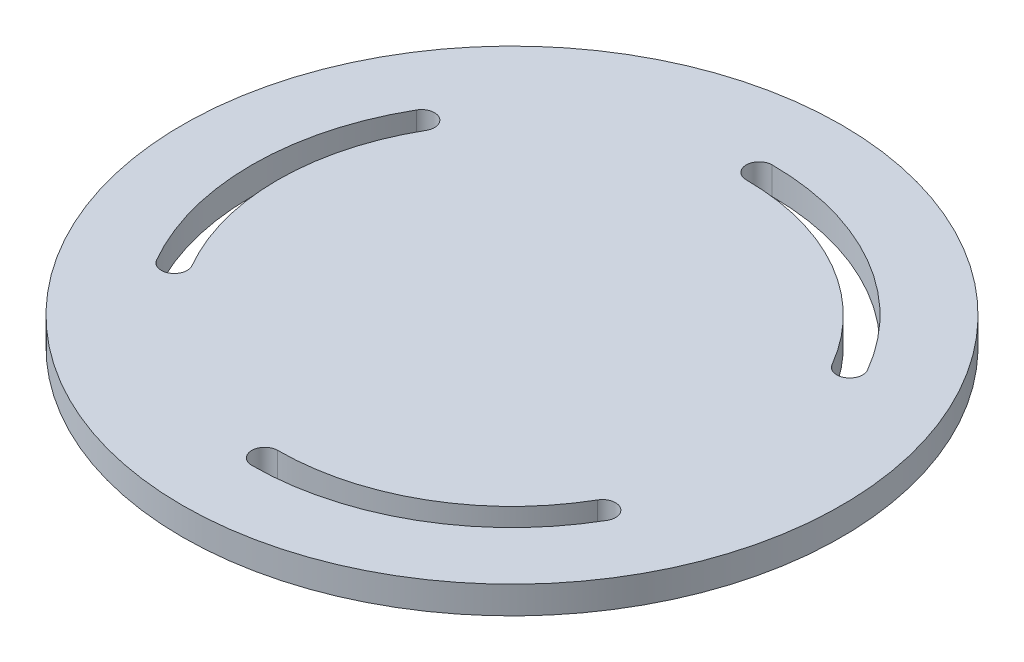
ISO-10303-21;
HEADER;
FILE_DESCRIPTION(('STEP AP214'),'2;1');
FILE_NAME('part.step','',(''),(''),'','','');
FILE_SCHEMA(('AUTOMOTIVE_DESIGN { 1 0 10303 214 1 1 1 1 }'));
ENDSEC;
DATA;
#1=APPLICATION_CONTEXT('core data for automotive mechanical design processes');
#2=APPLICATION_PROTOCOL_DEFINITION('international standard','automotive_design',2000,#1);
#3=PRODUCT_CONTEXT('',#1,'mechanical');
#4=PRODUCT('Part','Part','',(#3));
#5=PRODUCT_RELATED_PRODUCT_CATEGORY('part','',(#4));
#6=PRODUCT_DEFINITION_FORMATION('','',#4);
#7=PRODUCT_DEFINITION_CONTEXT('part definition',#1,'design');
#8=PRODUCT_DEFINITION('design','',#6,#7);
#9=PRODUCT_DEFINITION_SHAPE('','',#8);
#10=(LENGTH_UNIT() NAMED_UNIT(*) SI_UNIT(.MILLI.,.METRE.));
#11=(NAMED_UNIT(*) PLANE_ANGLE_UNIT() SI_UNIT($,.RADIAN.));
#12=(NAMED_UNIT(*) SI_UNIT($,.STERADIAN.) SOLID_ANGLE_UNIT());
#13=UNCERTAINTY_MEASURE_WITH_UNIT(LENGTH_MEASURE(1.E-05),#10,'distance_accuracy_value','');
#14=(GEOMETRIC_REPRESENTATION_CONTEXT(3) GLOBAL_UNCERTAINTY_ASSIGNED_CONTEXT((#13)) GLOBAL_UNIT_ASSIGNED_CONTEXT((#10,
#11,#12)) REPRESENTATION_CONTEXT('',''));
#15=CARTESIAN_POINT('',(0.,0.,0.));
#16=DIRECTION('',(0.,0.,1.));
#17=DIRECTION('',(1.,0.,0.));
#18=AXIS2_PLACEMENT_3D('',#15,#16,#17);
#19=CARTESIAN_POINT('',(0.,-6.35,0.));
#20=DIRECTION('',(0.,1.,0.));
#21=DIRECTION('',(0.,0.,1.));
#22=AXIS2_PLACEMENT_3D('',#19,#20,#21);
#23=CYLINDRICAL_SURFACE('',#22,76.1746);
#24=CARTESIAN_POINT('',(0.,-6.35,0.));
#25=DIRECTION('',(0.,1.,0.));
#26=DIRECTION('',(0.,0.,1.));
#27=AXIS2_PLACEMENT_3D('',#24,#25,#26);
#28=CIRCLE('',#27,76.1746);
#29=CARTESIAN_POINT('',(0.,-6.35,76.1746));
#30=VERTEX_POINT('',#29);
#31=EDGE_CURVE('E11',#30,#30,#28,.T.);
#32=ORIENTED_EDGE('',*,*,#31,.T.);
#33=EDGE_LOOP('',(#32));
#34=FACE_BOUND('',#33,.T.);
#35=CARTESIAN_POINT('',(0.,0.,0.));
#36=DIRECTION('',(0.,1.,0.));
#37=DIRECTION('',(0.,0.,1.));
#38=AXIS2_PLACEMENT_3D('',#35,#36,#37);
#39=CIRCLE('',#38,76.1746);
#40=CARTESIAN_POINT('',(0.,0.,76.1746));
#41=VERTEX_POINT('',#40);
#42=EDGE_CURVE('E36',#41,#41,#39,.T.);
#43=ORIENTED_EDGE('',*,*,#42,.F.);
#44=EDGE_LOOP('',(#43));
#45=FACE_BOUND('',#44,.T.);
#46=ADVANCED_FACE('F33',(#34,#45),#23,.T.);
#47=CARTESIAN_POINT('',(0.,-6.35,0.));
#48=DIRECTION('',(0.,1.,0.));
#49=DIRECTION('',(0.,0.,1.));
#50=AXIS2_PLACEMENT_3D('',#47,#48,#49);
#51=PLANE('',#50);
#52=CARTESIAN_POINT('',(-49.4933518262799,-6.35,-28.5749999999988));
#53=DIRECTION('',(0.,1.,0.));
#54=DIRECTION('',(0.,0.,1.));
#55=AXIS2_PLACEMENT_3D('',#52,#53,#54);
#56=CIRCLE('',#55,2.999999969);
#57=CARTESIAN_POINT('',(-46.8952756417734,-6.35,-27.0750000154987));
#58=VERTEX_POINT('',#57);
#59=CARTESIAN_POINT('',(-52.0914280107864,-6.35,-30.0749999844988));
#60=VERTEX_POINT('',#59);
#61=EDGE_CURVE('E129',#58,#60,#56,.T.);
#62=ORIENTED_EDGE('',*,*,#61,.T.);
#63=CARTESIAN_POINT('',(0.,-6.35,0.));
#64=DIRECTION('',(0.,1.,0.));
#65=DIRECTION('',(0.,0.,1.));
#66=AXIS2_PLACEMENT_3D('',#63,#64,#65);
#67=CIRCLE('',#66,60.1499999689994);
#68=CARTESIAN_POINT('',(-52.0914280107864,-6.35,30.0749999845013));
#69=VERTEX_POINT('',#68);
#70=EDGE_CURVE('E123',#60,#69,#67,.T.);
#71=ORIENTED_EDGE('',*,*,#70,.T.);
#72=CARTESIAN_POINT('',(-49.4933518262799,-6.35,28.5750000000014));
#73=DIRECTION('',(0.,1.,0.));
#74=DIRECTION('',(0.,0.,1.));
#75=AXIS2_PLACEMENT_3D('',#72,#73,#74);
#76=CIRCLE('',#75,2.999999969);
#77=CARTESIAN_POINT('',(-46.8952756417741,-6.35,27.0750000155));
#78=VERTEX_POINT('',#77);
#79=EDGE_CURVE('E132',#69,#78,#76,.T.);
#80=ORIENTED_EDGE('',*,*,#79,.T.);
#81=CARTESIAN_POINT('',(0.,-6.35,0.));
#82=DIRECTION('',(0.,-1.,0.));
#83=DIRECTION('',(0.,0.,1.));
#84=AXIS2_PLACEMENT_3D('',#81,#82,#83);
#85=CIRCLE('',#84,54.1500000309994);
#86=EDGE_CURVE('E47',#78,#58,#85,.T.);
#87=ORIENTED_EDGE('',*,*,#86,.T.);
#88=EDGE_LOOP('',(#62,#71,#80,#87));
#89=FACE_BOUND('',#88,.T.);
#90=CARTESIAN_POINT('',(-3.95516952522712E-13,-6.35,57.15));
#91=DIRECTION('',(0.,1.,0.));
#92=DIRECTION('',(0.,0.,1.));
#93=AXIS2_PLACEMENT_3D('',#90,#91,#92);
#94=CIRCLE('',#93,2.99999996899934);
#95=CARTESIAN_POINT('',(7.053034921501E-13,-6.35,54.1500000310007));
#96=VERTEX_POINT('',#95);
#97=CARTESIAN_POINT('',(-3.95516952522712E-13,-6.35,60.1499999689994));
#98=VERTEX_POINT('',#97);
#99=EDGE_CURVE('E168',#96,#98,#94,.T.);
#100=ORIENTED_EDGE('',*,*,#99,.T.);
#101=CARTESIAN_POINT('',(0.,-6.35,0.));
#102=DIRECTION('',(0.,1.,0.));
#103=DIRECTION('',(0.,0.,1.));
#104=AXIS2_PLACEMENT_3D('',#101,#102,#103);
#105=CIRCLE('',#104,60.149999969);
#106=CARTESIAN_POINT('',(52.0914280107871,-6.35,30.0749999845002));
#107=VERTEX_POINT('',#106);
#108=EDGE_CURVE('E158',#98,#107,#105,.T.);
#109=ORIENTED_EDGE('',*,*,#108,.T.);
#110=CARTESIAN_POINT('',(49.4933518262805,-6.35,28.5750000000002));
#111=DIRECTION('',(0.,1.,0.));
#112=DIRECTION('',(0.,0.,1.));
#113=AXIS2_PLACEMENT_3D('',#110,#111,#112);
#114=CIRCLE('',#113,2.999999969);
#115=CARTESIAN_POINT('',(46.8952756417742,-6.35,27.0750000155));
#116=VERTEX_POINT('',#115);
#117=EDGE_CURVE('E161',#107,#116,#114,.T.);
#118=ORIENTED_EDGE('',*,*,#117,.T.);
#119=CARTESIAN_POINT('',(0.,-6.35,0.));
#120=DIRECTION('',(0.,-1.,0.));
#121=DIRECTION('',(0.,0.,1.));
#122=AXIS2_PLACEMENT_3D('',#119,#120,#121);
#123=CIRCLE('',#122,54.1500000310007);
#124=EDGE_CURVE('E165',#116,#96,#123,.T.);
#125=ORIENTED_EDGE('',*,*,#124,.T.);
#126=EDGE_LOOP('',(#100,#109,#118,#125));
#127=FACE_BOUND('',#126,.T.);
#128=CARTESIAN_POINT('',(0.,-6.35,0.));
#129=DIRECTION('',(0.,-1.,0.));
#130=DIRECTION('',(0.,0.,1.));
#131=AXIS2_PLACEMENT_3D('',#128,#129,#130);
#132=CIRCLE('',#131,54.150000031);
#133=CARTESIAN_POINT('',(0.,-6.35,-54.150000031));
#134=VERTEX_POINT('',#133);
#135=CARTESIAN_POINT('',(46.8952756417742,-6.35,-27.0750000154999));
#136=VERTEX_POINT('',#135);
#137=EDGE_CURVE('E200',#134,#136,#132,.T.);
#138=ORIENTED_EDGE('',*,*,#137,.T.);
#139=CARTESIAN_POINT('',(49.4933518262807,-6.35,-28.5749999999999));
#140=DIRECTION('',(0.,1.,0.));
#141=DIRECTION('',(0.,0.,1.));
#142=AXIS2_PLACEMENT_3D('',#139,#140,#141);
#143=CIRCLE('',#142,2.99999996899999);
#144=CARTESIAN_POINT('',(52.0914280107873,-6.35,-30.0749999844999));
#145=VERTEX_POINT('',#144);
#146=EDGE_CURVE('E190',#136,#145,#143,.T.);
#147=ORIENTED_EDGE('',*,*,#146,.T.);
#148=CARTESIAN_POINT('',(0.,-6.35,0.));
#149=DIRECTION('',(0.,1.,0.));
#150=DIRECTION('',(0.,0.,1.));
#151=AXIS2_PLACEMENT_3D('',#148,#149,#150);
#152=CIRCLE('',#151,60.149999969);
#153=CARTESIAN_POINT('',(0.,-6.35,-60.149999969));
#154=VERTEX_POINT('',#153);
#155=EDGE_CURVE('E193',#145,#154,#152,.T.);
#156=ORIENTED_EDGE('',*,*,#155,.T.);
#157=CARTESIAN_POINT('',(0.,-6.35,-57.15));
#158=DIRECTION('',(0.,1.,0.));
#159=DIRECTION('',(0.,0.,1.));
#160=AXIS2_PLACEMENT_3D('',#157,#158,#159);
#161=CIRCLE('',#160,2.99999996899999);
#162=EDGE_CURVE('E197',#154,#134,#161,.T.);
#163=ORIENTED_EDGE('',*,*,#162,.T.);
#164=EDGE_LOOP('',(#138,#147,#156,#163));
#165=FACE_BOUND('',#164,.T.);
#166=ORIENTED_EDGE('',*,*,#31,.F.);
#167=EDGE_LOOP('',(#166));
#168=FACE_BOUND('',#167,.T.);
#169=ADVANCED_FACE('F136',(#89,#127,#165,#168),#51,.F.);
#170=CARTESIAN_POINT('',(0.,0.,0.));
#171=DIRECTION('',(0.,1.,0.));
#172=DIRECTION('',(0.,0.,1.));
#173=AXIS2_PLACEMENT_3D('',#170,#171,#172);
#174=PLANE('',#173);
#175=CARTESIAN_POINT('',(0.,0.,0.));
#176=DIRECTION('',(0.,1.,0.));
#177=DIRECTION('',(0.,0.,1.));
#178=AXIS2_PLACEMENT_3D('',#175,#176,#177);
#179=CIRCLE('',#178,60.1499999689994);
#180=CARTESIAN_POINT('',(-52.0914280107864,0.,-30.0749999844988));
#181=VERTEX_POINT('',#180);
#182=CARTESIAN_POINT('',(-52.0914280107864,0.,30.0749999845013));
#183=VERTEX_POINT('',#182);
#184=EDGE_CURVE('E55',#181,#183,#179,.T.);
#185=ORIENTED_EDGE('',*,*,#184,.F.);
#186=CARTESIAN_POINT('',(-49.4933518262799,0.,-28.5749999999988));
#187=DIRECTION('',(0.,1.,0.));
#188=DIRECTION('',(0.,0.,1.));
#189=AXIS2_PLACEMENT_3D('',#186,#187,#188);
#190=CIRCLE('',#189,2.999999969);
#191=CARTESIAN_POINT('',(-46.8952756417734,0.,-27.0750000154987));
#192=VERTEX_POINT('',#191);
#193=EDGE_CURVE('E139',#192,#181,#190,.T.);
#194=ORIENTED_EDGE('',*,*,#193,.F.);
#195=CARTESIAN_POINT('',(0.,0.,0.));
#196=DIRECTION('',(0.,-1.,0.));
#197=DIRECTION('',(0.,0.,1.));
#198=AXIS2_PLACEMENT_3D('',#195,#196,#197);
#199=CIRCLE('',#198,54.1500000309994);
#200=CARTESIAN_POINT('',(-46.8952756417736,0.,27.0750000154997));
#201=VERTEX_POINT('',#200);
#202=EDGE_CURVE('E142',#201,#192,#199,.T.);
#203=ORIENTED_EDGE('',*,*,#202,.F.);
#204=CARTESIAN_POINT('',(-49.4933518262799,0.,28.5750000000014));
#205=DIRECTION('',(0.,1.,0.));
#206=DIRECTION('',(0.,0.,1.));
#207=AXIS2_PLACEMENT_3D('',#204,#205,#206);
#208=CIRCLE('',#207,2.999999969);
#209=EDGE_CURVE('E148',#183,#201,#208,.T.);
#210=ORIENTED_EDGE('',*,*,#209,.F.);
#211=EDGE_LOOP('',(#185,#194,#203,#210));
#212=FACE_BOUND('',#211,.T.);
#213=CARTESIAN_POINT('',(0.,0.,0.));
#214=DIRECTION('',(0.,1.,0.));
#215=DIRECTION('',(0.,0.,1.));
#216=AXIS2_PLACEMENT_3D('',#213,#214,#215);
#217=CIRCLE('',#216,60.149999969);
#218=CARTESIAN_POINT('',(-3.95516952522712E-13,0.,60.1499999689994));
#219=VERTEX_POINT('',#218);
#220=CARTESIAN_POINT('',(52.0914280107871,0.,30.0749999845002));
#221=VERTEX_POINT('',#220);
#222=EDGE_CURVE('E154',#219,#221,#217,.T.);
#223=ORIENTED_EDGE('',*,*,#222,.F.);
#224=CARTESIAN_POINT('',(-3.95516952522712E-13,0.,57.15));
#225=DIRECTION('',(0.,1.,0.));
#226=DIRECTION('',(0.,0.,1.));
#227=AXIS2_PLACEMENT_3D('',#224,#225,#226);
#228=CIRCLE('',#227,2.99999996899934);
#229=CARTESIAN_POINT('',(7.053034921501E-13,0.,54.1500000310007));
#230=VERTEX_POINT('',#229);
#231=EDGE_CURVE('E162',#230,#219,#228,.T.);
#232=ORIENTED_EDGE('',*,*,#231,.F.);
#233=CARTESIAN_POINT('',(0.,0.,0.));
#234=DIRECTION('',(0.,-1.,0.));
#235=DIRECTION('',(0.,0.,1.));
#236=AXIS2_PLACEMENT_3D('',#233,#234,#235);
#237=CIRCLE('',#236,54.1500000310007);
#238=CARTESIAN_POINT('',(46.8952756417747,0.,27.0750000155003));
#239=VERTEX_POINT('',#238);
#240=EDGE_CURVE('E176',#239,#230,#237,.T.);
#241=ORIENTED_EDGE('',*,*,#240,.F.);
#242=CARTESIAN_POINT('',(49.4933518262805,0.,28.5750000000002));
#243=DIRECTION('',(0.,1.,0.));
#244=DIRECTION('',(0.,0.,1.));
#245=AXIS2_PLACEMENT_3D('',#242,#243,#244);
#246=CIRCLE('',#245,2.999999969);
#247=EDGE_CURVE('E173',#221,#239,#246,.T.);
#248=ORIENTED_EDGE('',*,*,#247,.F.);
#249=EDGE_LOOP('',(#223,#232,#241,#248));
#250=FACE_BOUND('',#249,.T.);
#251=CARTESIAN_POINT('',(49.4933518262807,0.,-28.5749999999999));
#252=DIRECTION('',(0.,1.,0.));
#253=DIRECTION('',(0.,0.,1.));
#254=AXIS2_PLACEMENT_3D('',#251,#252,#253);
#255=CIRCLE('',#254,2.99999996899999);
#256=CARTESIAN_POINT('',(46.8952756417742,0.,-27.0750000154999));
#257=VERTEX_POINT('',#256);
#258=CARTESIAN_POINT('',(52.0914280107873,0.,-30.0749999844999));
#259=VERTEX_POINT('',#258);
#260=EDGE_CURVE('E183',#257,#259,#255,.T.);
#261=ORIENTED_EDGE('',*,*,#260,.F.);
#262=CARTESIAN_POINT('',(0.,0.,0.));
#263=DIRECTION('',(0.,-1.,0.));
#264=DIRECTION('',(0.,0.,1.));
#265=AXIS2_PLACEMENT_3D('',#262,#263,#264);
#266=CIRCLE('',#265,54.150000031);
#267=CARTESIAN_POINT('',(0.,0.,-54.150000031));
#268=VERTEX_POINT('',#267);
#269=EDGE_CURVE('E194',#268,#257,#266,.T.);
#270=ORIENTED_EDGE('',*,*,#269,.F.);
#271=CARTESIAN_POINT('',(0.,0.,-57.15));
#272=DIRECTION('',(0.,1.,0.));
#273=DIRECTION('',(0.,0.,1.));
#274=AXIS2_PLACEMENT_3D('',#271,#272,#273);
#275=CIRCLE('',#274,2.99999996899999);
#276=CARTESIAN_POINT('',(0.,0.,-60.149999969));
#277=VERTEX_POINT('',#276);
#278=EDGE_CURVE('E208',#277,#268,#275,.T.);
#279=ORIENTED_EDGE('',*,*,#278,.F.);
#280=CARTESIAN_POINT('',(0.,0.,0.));
#281=DIRECTION('',(0.,1.,0.));
#282=DIRECTION('',(0.,0.,1.));
#283=AXIS2_PLACEMENT_3D('',#280,#281,#282);
#284=CIRCLE('',#283,60.149999969);
#285=EDGE_CURVE('E205',#259,#277,#284,.T.);
#286=ORIENTED_EDGE('',*,*,#285,.F.);
#287=EDGE_LOOP('',(#261,#270,#279,#286));
#288=FACE_BOUND('',#287,.T.);
#289=ORIENTED_EDGE('',*,*,#42,.T.);
#290=EDGE_LOOP('',(#289));
#291=FACE_BOUND('',#290,.T.);
#292=ADVANCED_FACE('F230',(#212,#250,#288,#291),#174,.T.);
#293=CARTESIAN_POINT('',(49.4933518262807,-6.35,-28.5749999999999));
#294=DIRECTION('',(0.,1.,0.));
#295=DIRECTION('',(0.,0.,1.));
#296=AXIS2_PLACEMENT_3D('',#293,#294,#295);
#297=CYLINDRICAL_SURFACE('',#296,2.99999996899999);
#298=ORIENTED_EDGE('',*,*,#260,.T.);
#299=DIRECTION('',(0.,1.,0.));
#300=VECTOR('',#299,1.);
#301=CARTESIAN_POINT('',(52.0914280107873,-6.35,-30.0749999844999));
#302=LINE('',#301,#300);
#303=EDGE_CURVE('E203',#145,#259,#302,.T.);
#304=ORIENTED_EDGE('',*,*,#303,.F.);
#305=ORIENTED_EDGE('',*,*,#146,.F.);
#306=DIRECTION('',(0.,1.,0.));
#307=VECTOR('',#306,1.);
#308=CARTESIAN_POINT('',(46.8952756417742,-6.35,-27.0750000154999));
#309=LINE('',#308,#307);
#310=EDGE_CURVE('E213',#136,#257,#309,.T.);
#311=ORIENTED_EDGE('',*,*,#310,.T.);
#312=EDGE_LOOP('',(#298,#304,#305,#311));
#313=FACE_BOUND('',#312,.T.);
#314=ADVANCED_FACE('F238',(#313),#297,.F.);
#315=CARTESIAN_POINT('',(0.,-6.35,0.));
#316=DIRECTION('',(0.,1.,0.));
#317=DIRECTION('',(0.,0.,1.));
#318=AXIS2_PLACEMENT_3D('',#315,#316,#317);
#319=CYLINDRICAL_SURFACE('',#318,54.150000031);
#320=ORIENTED_EDGE('',*,*,#269,.T.);
#321=ORIENTED_EDGE('',*,*,#310,.F.);
#322=ORIENTED_EDGE('',*,*,#137,.F.);
#323=DIRECTION('',(0.,1.,0.));
#324=VECTOR('',#323,1.);
#325=CARTESIAN_POINT('',(0.,-6.35,-54.150000031));
#326=LINE('',#325,#324);
#327=EDGE_CURVE('E215',#134,#268,#326,.T.);
#328=ORIENTED_EDGE('',*,*,#327,.T.);
#329=EDGE_LOOP('',(#320,#321,#322,#328));
#330=FACE_BOUND('',#329,.T.);
#331=ADVANCED_FACE('F240',(#330),#319,.T.);
#332=CARTESIAN_POINT('',(0.,-6.35,-57.15));
#333=DIRECTION('',(0.,1.,0.));
#334=DIRECTION('',(0.,0.,1.));
#335=AXIS2_PLACEMENT_3D('',#332,#333,#334);
#336=CYLINDRICAL_SURFACE('',#335,2.99999996899999);
#337=ORIENTED_EDGE('',*,*,#278,.T.);
#338=ORIENTED_EDGE('',*,*,#327,.F.);
#339=ORIENTED_EDGE('',*,*,#162,.F.);
#340=DIRECTION('',(0.,1.,0.));
#341=VECTOR('',#340,1.);
#342=CARTESIAN_POINT('',(0.,-6.35,-60.149999969));
#343=LINE('',#342,#341);
#344=EDGE_CURVE('E217',#154,#277,#343,.T.);
#345=ORIENTED_EDGE('',*,*,#344,.T.);
#346=EDGE_LOOP('',(#337,#338,#339,#345));
#347=FACE_BOUND('',#346,.T.);
#348=ADVANCED_FACE('F234',(#347),#336,.F.);
#349=CARTESIAN_POINT('',(0.,-6.35,0.));
#350=DIRECTION('',(0.,1.,0.));
#351=DIRECTION('',(0.,0.,1.));
#352=AXIS2_PLACEMENT_3D('',#349,#350,#351);
#353=CYLINDRICAL_SURFACE('',#352,60.149999969);
#354=ORIENTED_EDGE('',*,*,#285,.T.);
#355=ORIENTED_EDGE('',*,*,#344,.F.);
#356=ORIENTED_EDGE('',*,*,#155,.F.);
#357=ORIENTED_EDGE('',*,*,#303,.T.);
#358=EDGE_LOOP('',(#354,#355,#356,#357));
#359=FACE_BOUND('',#358,.T.);
#360=ADVANCED_FACE('F223',(#359),#353,.F.);
#361=CARTESIAN_POINT('',(0.,-6.35,0.));
#362=DIRECTION('',(0.,1.,0.));
#363=DIRECTION('',(0.,0.,1.));
#364=AXIS2_PLACEMENT_3D('',#361,#362,#363);
#365=CYLINDRICAL_SURFACE('',#364,60.149999969);
#366=ORIENTED_EDGE('',*,*,#222,.T.);
#367=DIRECTION('',(0.,1.,0.));
#368=VECTOR('',#367,1.);
#369=CARTESIAN_POINT('',(52.0914280107871,-6.35,30.0749999845002));
#370=LINE('',#369,#368);
#371=EDGE_CURVE('E171',#107,#221,#370,.T.);
#372=ORIENTED_EDGE('',*,*,#371,.F.);
#373=ORIENTED_EDGE('',*,*,#108,.F.);
#374=DIRECTION('',(0.,1.,0.));
#375=VECTOR('',#374,1.);
#376=CARTESIAN_POINT('',(-3.95516952522712E-13,-6.35,60.1499999689994));
#377=LINE('',#376,#375);
#378=EDGE_CURVE('E181',#98,#219,#377,.T.);
#379=ORIENTED_EDGE('',*,*,#378,.T.);
#380=EDGE_LOOP('',(#366,#372,#373,#379));
#381=FACE_BOUND('',#380,.T.);
#382=ADVANCED_FACE('F267',(#381),#365,.F.);
#383=CARTESIAN_POINT('',(-3.95516952522712E-13,-6.35,57.15));
#384=DIRECTION('',(0.,1.,0.));
#385=DIRECTION('',(0.,0.,1.));
#386=AXIS2_PLACEMENT_3D('',#383,#384,#385);
#387=CYLINDRICAL_SURFACE('',#386,2.99999996899934);
#388=ORIENTED_EDGE('',*,*,#231,.T.);
#389=ORIENTED_EDGE('',*,*,#378,.F.);
#390=ORIENTED_EDGE('',*,*,#99,.F.);
#391=DIRECTION('',(0.,1.,0.));
#392=VECTOR('',#391,1.);
#393=CARTESIAN_POINT('',(7.053034921501E-13,-6.35,54.1500000310007));
#394=LINE('',#393,#392);
#395=EDGE_CURVE('E184',#96,#230,#394,.T.);
#396=ORIENTED_EDGE('',*,*,#395,.T.);
#397=EDGE_LOOP('',(#388,#389,#390,#396));
#398=FACE_BOUND('',#397,.T.);
#399=ADVANCED_FACE('F271',(#398),#387,.F.);
#400=CARTESIAN_POINT('',(0.,-6.35,0.));
#401=DIRECTION('',(0.,1.,0.));
#402=DIRECTION('',(0.,0.,1.));
#403=AXIS2_PLACEMENT_3D('',#400,#401,#402);
#404=CYLINDRICAL_SURFACE('',#403,54.1500000310007);
#405=ORIENTED_EDGE('',*,*,#240,.T.);
#406=ORIENTED_EDGE('',*,*,#395,.F.);
#407=ORIENTED_EDGE('',*,*,#124,.F.);
#408=DIRECTION('',(0.,1.,0.));
#409=VECTOR('',#408,1.);
#410=CARTESIAN_POINT('',(46.8952756417747,-6.35,27.0750000155003));
#411=LINE('',#410,#409);
#412=EDGE_CURVE('E186',#116,#239,#411,.T.);
#413=ORIENTED_EDGE('',*,*,#412,.T.);
#414=EDGE_LOOP('',(#405,#406,#407,#413));
#415=FACE_BOUND('',#414,.T.);
#416=ADVANCED_FACE('F276',(#415),#404,.T.);
#417=CARTESIAN_POINT('',(49.4933518262805,-6.35,28.5750000000002));
#418=DIRECTION('',(0.,1.,0.));
#419=DIRECTION('',(0.,0.,1.));
#420=AXIS2_PLACEMENT_3D('',#417,#418,#419);
#421=CYLINDRICAL_SURFACE('',#420,2.999999969);
#422=ORIENTED_EDGE('',*,*,#247,.T.);
#423=ORIENTED_EDGE('',*,*,#412,.F.);
#424=ORIENTED_EDGE('',*,*,#117,.F.);
#425=ORIENTED_EDGE('',*,*,#371,.T.);
#426=EDGE_LOOP('',(#422,#423,#424,#425));
#427=FACE_BOUND('',#426,.T.);
#428=ADVANCED_FACE('F280',(#427),#421,.F.);
#429=CARTESIAN_POINT('',(0.,-6.35,0.));
#430=DIRECTION('',(0.,1.,0.));
#431=DIRECTION('',(0.,0.,1.));
#432=AXIS2_PLACEMENT_3D('',#429,#430,#431);
#433=CYLINDRICAL_SURFACE('',#432,60.1499999689994);
#434=ORIENTED_EDGE('',*,*,#184,.T.);
#435=DIRECTION('',(0.,1.,0.));
#436=VECTOR('',#435,1.);
#437=CARTESIAN_POINT('',(-52.0914280107864,-6.35,30.0749999845013));
#438=LINE('',#437,#436);
#439=EDGE_CURVE('E119',#69,#183,#438,.T.);
#440=ORIENTED_EDGE('',*,*,#439,.F.);
#441=ORIENTED_EDGE('',*,*,#70,.F.);
#442=DIRECTION('',(0.,1.,0.));
#443=VECTOR('',#442,1.);
#444=CARTESIAN_POINT('',(-52.0914280107864,-6.35,-30.0749999844988));
#445=LINE('',#444,#443);
#446=EDGE_CURVE('E152',#60,#181,#445,.T.);
#447=ORIENTED_EDGE('',*,*,#446,.T.);
#448=EDGE_LOOP('',(#434,#440,#441,#447));
#449=FACE_BOUND('',#448,.T.);
#450=ADVANCED_FACE('F121',(#449),#433,.F.);
#451=CARTESIAN_POINT('',(-49.4933518262799,-6.35,-28.5749999999988));
#452=DIRECTION('',(0.,1.,0.));
#453=DIRECTION('',(0.,0.,1.));
#454=AXIS2_PLACEMENT_3D('',#451,#452,#453);
#455=CYLINDRICAL_SURFACE('',#454,2.999999969);
#456=ORIENTED_EDGE('',*,*,#193,.T.);
#457=ORIENTED_EDGE('',*,*,#446,.F.);
#458=ORIENTED_EDGE('',*,*,#61,.F.);
#459=DIRECTION('',(0.,1.,0.));
#460=VECTOR('',#459,1.);
#461=CARTESIAN_POINT('',(-46.8952756417734,-6.35,-27.0750000154987));
#462=LINE('',#461,#460);
#463=EDGE_CURVE('E155',#58,#192,#462,.T.);
#464=ORIENTED_EDGE('',*,*,#463,.T.);
#465=EDGE_LOOP('',(#456,#457,#458,#464));
#466=FACE_BOUND('',#465,.T.);
#467=ADVANCED_FACE('F289',(#466),#455,.F.);
#468=CARTESIAN_POINT('',(0.,-6.35,0.));
#469=DIRECTION('',(0.,1.,0.));
#470=DIRECTION('',(0.,0.,1.));
#471=AXIS2_PLACEMENT_3D('',#468,#469,#470);
#472=CYLINDRICAL_SURFACE('',#471,54.1500000309994);
#473=ORIENTED_EDGE('',*,*,#202,.T.);
#474=ORIENTED_EDGE('',*,*,#463,.F.);
#475=ORIENTED_EDGE('',*,*,#86,.F.);
#476=DIRECTION('',(0.,1.,0.));
#477=VECTOR('',#476,1.);
#478=CARTESIAN_POINT('',(-46.8952756417736,-6.35,27.0750000154997));
#479=LINE('',#478,#477);
#480=EDGE_CURVE('E128',#78,#201,#479,.T.);
#481=ORIENTED_EDGE('',*,*,#480,.T.);
#482=EDGE_LOOP('',(#473,#474,#475,#481));
#483=FACE_BOUND('',#482,.T.);
#484=ADVANCED_FACE('F292',(#483),#472,.T.);
#485=CARTESIAN_POINT('',(-49.4933518262799,-6.35,28.5750000000014));
#486=DIRECTION('',(0.,1.,0.));
#487=DIRECTION('',(0.,0.,1.));
#488=AXIS2_PLACEMENT_3D('',#485,#486,#487);
#489=CYLINDRICAL_SURFACE('',#488,2.999999969);
#490=ORIENTED_EDGE('',*,*,#209,.T.);
#491=ORIENTED_EDGE('',*,*,#480,.F.);
#492=ORIENTED_EDGE('',*,*,#79,.F.);
#493=ORIENTED_EDGE('',*,*,#439,.T.);
#494=EDGE_LOOP('',(#490,#491,#492,#493));
#495=FACE_BOUND('',#494,.T.);
#496=ADVANCED_FACE('F133',(#495),#489,.F.);
#497=CLOSED_SHELL('',(#46,#169,#292,#314,#331,#348,#360,#382,#399,#416,#428,#450,#467,#484,#496));
#498=MANIFOLD_SOLID_BREP('B2',#497);
#499=ADVANCED_BREP_SHAPE_REPRESENTATION('',(#18,#498),#14);
#500=SHAPE_DEFINITION_REPRESENTATION(#9,#499);
ENDSEC;
END-ISO-10303-21;
